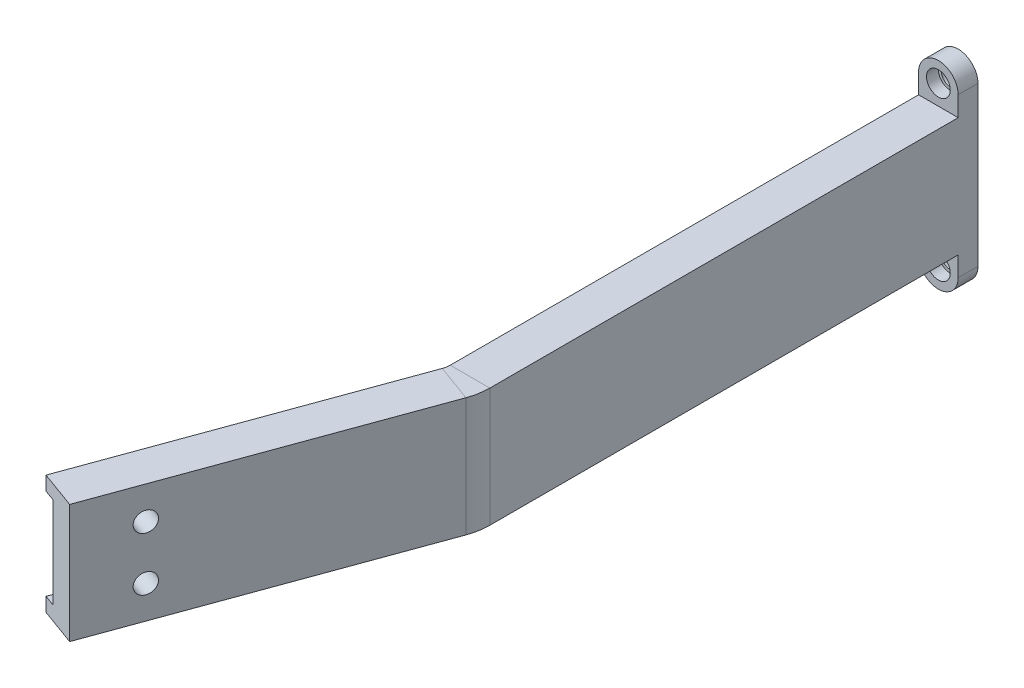
ISO-10303-21;
HEADER;
FILE_DESCRIPTION(('STEP AP214'),'2;1');
FILE_NAME('part.step','',(''),(''),'','','');
FILE_SCHEMA(('AUTOMOTIVE_DESIGN { 1 0 10303 214 1 1 1 1 }'));
ENDSEC;
DATA;
#1=APPLICATION_CONTEXT('core data for automotive mechanical design processes');
#2=APPLICATION_PROTOCOL_DEFINITION('international standard','automotive_design',2000,#1);
#3=PRODUCT_CONTEXT('',#1,'mechanical');
#4=PRODUCT('Part','Part','',(#3));
#5=PRODUCT_RELATED_PRODUCT_CATEGORY('part','',(#4));
#6=PRODUCT_DEFINITION_FORMATION('','',#4);
#7=PRODUCT_DEFINITION_CONTEXT('part definition',#1,'design');
#8=PRODUCT_DEFINITION('design','',#6,#7);
#9=PRODUCT_DEFINITION_SHAPE('','',#8);
#10=(LENGTH_UNIT() NAMED_UNIT(*) SI_UNIT(.MILLI.,.METRE.));
#11=(NAMED_UNIT(*) PLANE_ANGLE_UNIT() SI_UNIT($,.RADIAN.));
#12=(NAMED_UNIT(*) SI_UNIT($,.STERADIAN.) SOLID_ANGLE_UNIT());
#13=UNCERTAINTY_MEASURE_WITH_UNIT(LENGTH_MEASURE(1.E-05),#10,'distance_accuracy_value','');
#14=(GEOMETRIC_REPRESENTATION_CONTEXT(3) GLOBAL_UNCERTAINTY_ASSIGNED_CONTEXT((#13)) GLOBAL_UNIT_ASSIGNED_CONTEXT((#10,
#11,#12)) REPRESENTATION_CONTEXT('',''));
#15=CARTESIAN_POINT('',(0.,0.,0.));
#16=DIRECTION('',(0.,0.,1.));
#17=DIRECTION('',(1.,0.,0.));
#18=AXIS2_PLACEMENT_3D('',#15,#16,#17);
#19=CARTESIAN_POINT('',(155.297767569966,-11.5,9.99999999999995));
#20=DIRECTION('',(-1.,0.,0.));
#21=DIRECTION('',(0.,0.,1.));
#22=AXIS2_PLACEMENT_3D('',#19,#20,#21);
#23=PLANE('',#22);
#24=DIRECTION('',(0.,0.,1.));
#25=VECTOR('',#24,1.);
#26=CARTESIAN_POINT('',(155.297767569966,11.5,9.99999999999995));
#27=LINE('',#26,#25);
#28=CARTESIAN_POINT('',(155.297767569966,11.5,155.));
#29=VERTEX_POINT('',#28);
#30=CARTESIAN_POINT('',(155.297767569965,11.5,278.236730192915));
#31=VERTEX_POINT('',#30);
#32=EDGE_CURVE('E242',#29,#31,#27,.T.);
#33=ORIENTED_EDGE('',*,*,#32,.F.);
#34=DIRECTION('',(0.,-1.,0.));
#35=VECTOR('',#34,1.);
#36=CARTESIAN_POINT('',(155.297767569966,-11.5,155.));
#37=LINE('',#36,#35);
#38=CARTESIAN_POINT('',(155.297767569966,-11.5,155.));
#39=VERTEX_POINT('',#38);
#40=EDGE_CURVE('E403',#29,#39,#37,.T.);
#41=ORIENTED_EDGE('',*,*,#40,.T.);
#42=DIRECTION('',(0.,0.,1.));
#43=VECTOR('',#42,1.);
#44=CARTESIAN_POINT('',(155.297767569966,-11.5,9.99999999999995));
#45=LINE('',#44,#43);
#46=CARTESIAN_POINT('',(155.297767569965,-11.5,278.236730192915));
#47=VERTEX_POINT('',#46);
#48=EDGE_CURVE('E241',#39,#47,#45,.T.);
#49=ORIENTED_EDGE('',*,*,#48,.T.);
#50=DIRECTION('',(0.,1.,0.));
#51=VECTOR('',#50,1.);
#52=CARTESIAN_POINT('',(155.297767569965,-11.5,278.236730192915));
#53=LINE('',#52,#51);
#54=EDGE_CURVE('E238',#31,#47,#53,.F.);
#55=ORIENTED_EDGE('',*,*,#54,.F.);
#56=EDGE_LOOP('',(#33,#41,#49,#55));
#57=FACE_BOUND('',#56,.T.);
#58=ADVANCED_FACE('F40',(#57),#23,.T.);
#59=CARTESIAN_POINT('',(155.297767569966,-11.5,9.99999999999995));
#60=DIRECTION('',(0.,1.,0.));
#61=DIRECTION('',(0.,0.,1.));
#62=AXIS2_PLACEMENT_3D('',#59,#60,#61);
#63=PLANE('',#62);
#64=ORIENTED_EDGE('',*,*,#48,.F.);
#65=DIRECTION('',(-1.,0.,0.));
#66=VECTOR('',#65,1.);
#67=CARTESIAN_POINT('',(155.297767569966,-11.5,155.));
#68=LINE('',#67,#66);
#69=CARTESIAN_POINT('',(152.297767569966,-11.5,155.));
#70=VERTEX_POINT('',#69);
#71=EDGE_CURVE('E407',#39,#70,#68,.T.);
#72=ORIENTED_EDGE('',*,*,#71,.T.);
#73=DIRECTION('',(0.,0.,1.));
#74=VECTOR('',#73,1.);
#75=CARTESIAN_POINT('',(152.297767569966,-11.5,9.99999999999995));
#76=LINE('',#75,#74);
#77=CARTESIAN_POINT('',(152.297767569966,-11.5,278.236730192915));
#78=VERTEX_POINT('',#77);
#79=EDGE_CURVE('E269',#70,#78,#76,.T.);
#80=ORIENTED_EDGE('',*,*,#79,.T.);
#81=DIRECTION('',(1.,0.,0.));
#82=VECTOR('',#81,1.);
#83=CARTESIAN_POINT('',(155.297767569965,-11.5,278.236730192915));
#84=LINE('',#83,#82);
#85=EDGE_CURVE('E244',#47,#78,#84,.F.);
#86=ORIENTED_EDGE('',*,*,#85,.F.);
#87=EDGE_LOOP('',(#64,#72,#80,#86));
#88=FACE_BOUND('',#87,.T.);
#89=ADVANCED_FACE('F406',(#88),#63,.T.);
#90=CARTESIAN_POINT('',(152.297767569966,-15.,9.99999999999995));
#91=DIRECTION('',(-1.,1.50408162385987E-13,0.));
#92=DIRECTION('',(-1.50408162385987E-13,-1.,0.));
#93=AXIS2_PLACEMENT_3D('',#90,#91,#92);
#94=PLANE('',#93);
#95=ORIENTED_EDGE('',*,*,#79,.F.);
#96=DIRECTION('',(-1.50408162385987E-13,-1.,0.));
#97=VECTOR('',#96,1.);
#98=CARTESIAN_POINT('',(152.297767569966,-15.,155.));
#99=LINE('',#98,#97);
#100=CARTESIAN_POINT('',(152.297767569966,-19.9999999999989,155.));
#101=VERTEX_POINT('',#100);
#102=EDGE_CURVE('E452',#70,#101,#99,.T.);
#103=ORIENTED_EDGE('',*,*,#102,.T.);
#104=DIRECTION('',(0.,0.,-1.));
#105=VECTOR('',#104,1.);
#106=CARTESIAN_POINT('',(152.297767569966,-19.9999999999989,160.));
#107=LINE('',#106,#105);
#108=CARTESIAN_POINT('',(152.297767569966,-19.9999999999989,160.));
#109=VERTEX_POINT('',#108);
#110=EDGE_CURVE('E217',#109,#101,#107,.T.);
#111=ORIENTED_EDGE('',*,*,#110,.F.);
#112=DIRECTION('',(0.,-1.,0.));
#113=VECTOR('',#112,1.);
#114=CARTESIAN_POINT('',(152.297767569965,-14.9999999999989,160.));
#115=LINE('',#114,#113);
#116=CARTESIAN_POINT('',(152.297767569966,-15.,160.));
#117=VERTEX_POINT('',#116);
#118=EDGE_CURVE('E220',#117,#109,#115,.T.);
#119=ORIENTED_EDGE('',*,*,#118,.F.);
#120=DIRECTION('',(0.,0.,1.));
#121=VECTOR('',#120,1.);
#122=CARTESIAN_POINT('',(152.297767569966,-15.,9.99999999999995));
#123=LINE('',#122,#121);
#124=CARTESIAN_POINT('',(152.297767569965,-15.,278.236730192915));
#125=VERTEX_POINT('',#124);
#126=EDGE_CURVE('E285',#117,#125,#123,.T.);
#127=ORIENTED_EDGE('',*,*,#126,.T.);
#128=DIRECTION('',(1.50408162385987E-13,1.,0.));
#129=VECTOR('',#128,1.);
#130=CARTESIAN_POINT('',(152.297767569965,-15.,278.236730192915));
#131=LINE('',#130,#129);
#132=EDGE_CURVE('E271',#78,#125,#131,.F.);
#133=ORIENTED_EDGE('',*,*,#132,.F.);
#134=EDGE_LOOP('',(#95,#103,#111,#119,#127,#133));
#135=FACE_BOUND('',#134,.T.);
#136=ADVANCED_FACE('F415',(#135),#94,.T.);
#137=CARTESIAN_POINT('',(162.297767569966,-15.,9.99999999999995));
#138=DIRECTION('',(1.,0.,0.));
#139=DIRECTION('',(0.,0.,-1.));
#140=AXIS2_PLACEMENT_3D('',#137,#138,#139);
#141=PLANE('',#140);
#142=DIRECTION('',(0.,0.,-1.));
#143=VECTOR('',#142,1.);
#144=CARTESIAN_POINT('',(162.297767569966,-19.9999999999989,160.));
#145=LINE('',#144,#143);
#146=CARTESIAN_POINT('',(162.297767569966,-19.9999999999989,160.));
#147=VERTEX_POINT('',#146);
#148=CARTESIAN_POINT('',(162.297767569966,-19.9999999999989,155.));
#149=VERTEX_POINT('',#148);
#150=EDGE_CURVE('E196',#147,#149,#145,.T.);
#151=ORIENTED_EDGE('',*,*,#150,.T.);
#152=DIRECTION('',(0.,1.,0.));
#153=VECTOR('',#152,1.);
#154=CARTESIAN_POINT('',(162.297767569966,-15.,155.));
#155=LINE('',#154,#153);
#156=CARTESIAN_POINT('',(162.297767569965,20.0000000000013,155.));
#157=VERTEX_POINT('',#156);
#158=EDGE_CURVE('E180',#149,#157,#155,.T.);
#159=ORIENTED_EDGE('',*,*,#158,.T.);
#160=DIRECTION('',(0.,0.,-1.));
#161=VECTOR('',#160,1.);
#162=CARTESIAN_POINT('',(162.297767569965,20.0000000000013,160.));
#163=LINE('',#162,#161);
#164=CARTESIAN_POINT('',(162.297767569965,20.0000000000013,160.));
#165=VERTEX_POINT('',#164);
#166=EDGE_CURVE('E193',#165,#157,#163,.T.);
#167=ORIENTED_EDGE('',*,*,#166,.F.);
#168=DIRECTION('',(0.,1.,0.));
#169=VECTOR('',#168,1.);
#170=CARTESIAN_POINT('',(162.297767569965,15.0000000000013,160.));
#171=LINE('',#170,#169);
#172=CARTESIAN_POINT('',(162.297767569966,15.,160.));
#173=VERTEX_POINT('',#172);
#174=EDGE_CURVE('E202',#173,#165,#171,.T.);
#175=ORIENTED_EDGE('',*,*,#174,.F.);
#176=DIRECTION('',(0.,0.,1.));
#177=VECTOR('',#176,1.);
#178=CARTESIAN_POINT('',(162.297767569966,15.,9.99999999999995));
#179=LINE('',#178,#177);
#180=CARTESIAN_POINT('',(162.297767569965,15.,278.236730192915));
#181=VERTEX_POINT('',#180);
#182=EDGE_CURVE('E65',#173,#181,#179,.T.);
#183=ORIENTED_EDGE('',*,*,#182,.T.);
#184=DIRECTION('',(0.,-1.,0.));
#185=VECTOR('',#184,1.);
#186=CARTESIAN_POINT('',(162.297767569965,-15.,278.236730192915));
#187=LINE('',#186,#185);
#188=CARTESIAN_POINT('',(162.297767569965,-15.,278.236730192915));
#189=VERTEX_POINT('',#188);
#190=EDGE_CURVE('E303',#189,#181,#187,.F.);
#191=ORIENTED_EDGE('',*,*,#190,.F.);
#192=DIRECTION('',(0.,0.,1.));
#193=VECTOR('',#192,1.);
#194=CARTESIAN_POINT('',(162.297767569966,-15.,9.99999999999995));
#195=LINE('',#194,#193);
#196=CARTESIAN_POINT('',(162.297767569965,-14.9999999999989,160.));
#197=VERTEX_POINT('',#196);
#198=EDGE_CURVE('E301',#197,#189,#195,.T.);
#199=ORIENTED_EDGE('',*,*,#198,.F.);
#200=DIRECTION('',(0.,1.,0.));
#201=VECTOR('',#200,1.);
#202=CARTESIAN_POINT('',(162.297767569965,-14.9999999999989,160.));
#203=LINE('',#202,#201);
#204=EDGE_CURVE('E225',#147,#197,#203,.T.);
#205=ORIENTED_EDGE('',*,*,#204,.F.);
#206=EDGE_LOOP('',(#151,#159,#167,#175,#183,#191,#199,#205));
#207=FACE_BOUND('',#206,.T.);
#208=ADVANCED_FACE('F191',(#207),#141,.T.);
#209=CARTESIAN_POINT('',(152.297767569966,11.5,9.99999999999995));
#210=DIRECTION('',(-1.,0.,0.));
#211=DIRECTION('',(0.,0.,1.));
#212=AXIS2_PLACEMENT_3D('',#209,#210,#211);
#213=PLANE('',#212);
#214=DIRECTION('',(0.,0.,-1.));
#215=VECTOR('',#214,1.);
#216=CARTESIAN_POINT('',(152.297767569965,20.0000000000009,160.));
#217=LINE('',#216,#215);
#218=CARTESIAN_POINT('',(152.297767569965,20.0000000000009,160.));
#219=VERTEX_POINT('',#218);
#220=CARTESIAN_POINT('',(152.297767569965,20.0000000000009,155.));
#221=VERTEX_POINT('',#220);
#222=EDGE_CURVE('E203',#219,#221,#217,.T.);
#223=ORIENTED_EDGE('',*,*,#222,.T.);
#224=DIRECTION('',(0.,-1.,0.));
#225=VECTOR('',#224,1.);
#226=CARTESIAN_POINT('',(152.297767569966,11.5,155.));
#227=LINE('',#226,#225);
#228=CARTESIAN_POINT('',(152.297767569966,11.5,155.));
#229=VERTEX_POINT('',#228);
#230=EDGE_CURVE('E57',#221,#229,#227,.T.);
#231=ORIENTED_EDGE('',*,*,#230,.T.);
#232=DIRECTION('',(0.,0.,1.));
#233=VECTOR('',#232,1.);
#234=CARTESIAN_POINT('',(152.297767569966,11.5,9.99999999999995));
#235=LINE('',#234,#233);
#236=CARTESIAN_POINT('',(152.297767569965,11.5,278.236730192915));
#237=VERTEX_POINT('',#236);
#238=EDGE_CURVE('E348',#229,#237,#235,.T.);
#239=ORIENTED_EDGE('',*,*,#238,.T.);
#240=DIRECTION('',(0.,1.,0.));
#241=VECTOR('',#240,1.);
#242=CARTESIAN_POINT('',(152.297767569965,11.5,278.236730192915));
#243=LINE('',#242,#241);
#244=CARTESIAN_POINT('',(152.297767569965,15.,278.236730192915));
#245=VERTEX_POINT('',#244);
#246=EDGE_CURVE('E334',#245,#237,#243,.F.);
#247=ORIENTED_EDGE('',*,*,#246,.F.);
#248=DIRECTION('',(0.,0.,1.));
#249=VECTOR('',#248,1.);
#250=CARTESIAN_POINT('',(152.297767569966,15.,9.99999999999995));
#251=LINE('',#250,#249);
#252=CARTESIAN_POINT('',(152.297767569965,15.0000000000009,160.));
#253=VERTEX_POINT('',#252);
#254=EDGE_CURVE('E332',#253,#245,#251,.T.);
#255=ORIENTED_EDGE('',*,*,#254,.F.);
#256=DIRECTION('',(0.,-1.,0.));
#257=VECTOR('',#256,1.);
#258=CARTESIAN_POINT('',(152.297767569965,15.0000000000009,160.));
#259=LINE('',#258,#257);
#260=EDGE_CURVE('E212',#219,#253,#259,.T.);
#261=ORIENTED_EDGE('',*,*,#260,.F.);
#262=EDGE_LOOP('',(#223,#231,#239,#247,#255,#261));
#263=FACE_BOUND('',#262,.T.);
#264=ADVANCED_FACE('F442',(#263),#213,.T.);
#265=CARTESIAN_POINT('',(155.297767569966,11.5,9.99999999999995));
#266=DIRECTION('',(0.,-1.,0.));
#267=DIRECTION('',(0.,0.,-1.));
#268=AXIS2_PLACEMENT_3D('',#265,#266,#267);
#269=PLANE('',#268);
#270=ORIENTED_EDGE('',*,*,#238,.F.);
#271=DIRECTION('',(1.,0.,0.));
#272=VECTOR('',#271,1.);
#273=CARTESIAN_POINT('',(155.297767569966,11.5,155.));
#274=LINE('',#273,#272);
#275=EDGE_CURVE('E451',#229,#29,#274,.T.);
#276=ORIENTED_EDGE('',*,*,#275,.T.);
#277=ORIENTED_EDGE('',*,*,#32,.T.);
#278=DIRECTION('',(-1.,0.,0.));
#279=VECTOR('',#278,1.);
#280=CARTESIAN_POINT('',(155.297767569965,11.5,278.236730192915));
#281=LINE('',#280,#279);
#282=EDGE_CURVE('E256',#237,#31,#281,.F.);
#283=ORIENTED_EDGE('',*,*,#282,.F.);
#284=EDGE_LOOP('',(#270,#276,#277,#283));
#285=FACE_BOUND('',#284,.T.);
#286=ADVANCED_FACE('F450',(#285),#269,.T.);
#287=CARTESIAN_POINT('',(157.297767569966,-19.9999999999989,160.));
#288=DIRECTION('',(0.,0.,-1.));
#289=DIRECTION('',(-1.,0.,0.));
#290=AXIS2_PLACEMENT_3D('',#287,#288,#289);
#291=CYLINDRICAL_SURFACE('',#290,5.);
#292=CARTESIAN_POINT('',(157.297767569966,-19.9999999999989,155.));
#293=DIRECTION('',(0.,0.,-1.));
#294=DIRECTION('',(-1.,0.,0.));
#295=AXIS2_PLACEMENT_3D('',#292,#293,#294);
#296=CIRCLE('',#295,5.);
#297=EDGE_CURVE('E197',#149,#101,#296,.T.);
#298=ORIENTED_EDGE('',*,*,#297,.F.);
#299=ORIENTED_EDGE('',*,*,#150,.F.);
#300=CARTESIAN_POINT('',(157.297767569966,-19.9999999999989,160.));
#301=DIRECTION('',(0.,0.,1.));
#302=DIRECTION('',(1.,0.,0.));
#303=AXIS2_PLACEMENT_3D('',#300,#301,#302);
#304=CIRCLE('',#303,5.);
#305=EDGE_CURVE('E228',#109,#147,#304,.T.);
#306=ORIENTED_EDGE('',*,*,#305,.F.);
#307=ORIENTED_EDGE('',*,*,#110,.T.);
#308=EDGE_LOOP('',(#298,#299,#306,#307));
#309=FACE_BOUND('',#308,.T.);
#310=ADVANCED_FACE('F500',(#309),#291,.T.);
#311=CARTESIAN_POINT('',(157.297767569965,20.0000000000009,160.));
#312=DIRECTION('',(0.,0.,-1.));
#313=DIRECTION('',(-1.,0.,0.));
#314=AXIS2_PLACEMENT_3D('',#311,#312,#313);
#315=CYLINDRICAL_SURFACE('',#314,5.);
#316=CARTESIAN_POINT('',(157.297767569965,20.0000000000009,155.));
#317=DIRECTION('',(0.,0.,-1.));
#318=DIRECTION('',(-1.,0.,0.));
#319=AXIS2_PLACEMENT_3D('',#316,#317,#318);
#320=CIRCLE('',#319,5.);
#321=EDGE_CURVE('E176',#221,#157,#320,.T.);
#322=ORIENTED_EDGE('',*,*,#321,.F.);
#323=ORIENTED_EDGE('',*,*,#222,.F.);
#324=CARTESIAN_POINT('',(157.297767569965,20.0000000000009,160.));
#325=DIRECTION('',(0.,0.,1.));
#326=DIRECTION('',(-1.,0.,0.));
#327=AXIS2_PLACEMENT_3D('',#324,#325,#326);
#328=CIRCLE('',#327,5.);
#329=EDGE_CURVE('E201',#165,#219,#328,.T.);
#330=ORIENTED_EDGE('',*,*,#329,.F.);
#331=ORIENTED_EDGE('',*,*,#166,.T.);
#332=EDGE_LOOP('',(#322,#323,#330,#331));
#333=FACE_BOUND('',#332,.T.);
#334=ADVANCED_FACE('F199',(#333),#315,.T.);
#335=CARTESIAN_POINT('',(157.297767569965,20.0000000000009,160.));
#336=DIRECTION('',(0.,0.,1.));
#337=DIRECTION('',(1.,0.,0.));
#338=AXIS2_PLACEMENT_3D('',#335,#336,#337);
#339=CYLINDRICAL_SURFACE('',#338,2.25);
#340=CARTESIAN_POINT('',(157.297767569965,20.0000000000009,157.));
#341=DIRECTION('',(0.,0.,1.));
#342=DIRECTION('',(1.,0.,0.));
#343=AXIS2_PLACEMENT_3D('',#340,#341,#342);
#344=CIRCLE('',#343,2.25);
#345=CARTESIAN_POINT('',(159.547767569965,20.0000000000009,157.));
#346=VERTEX_POINT('',#345);
#347=EDGE_CURVE('E468',#346,#346,#344,.T.);
#348=ORIENTED_EDGE('',*,*,#347,.T.);
#349=EDGE_LOOP('',(#348));
#350=FACE_BOUND('',#349,.T.);
#351=CARTESIAN_POINT('',(157.297767569965,20.0000000000009,155.));
#352=DIRECTION('',(0.,0.,-1.));
#353=DIRECTION('',(-1.,0.,0.));
#354=AXIS2_PLACEMENT_3D('',#351,#352,#353);
#355=CIRCLE('',#354,2.25);
#356=CARTESIAN_POINT('',(155.047767569965,20.0000000000009,155.));
#357=VERTEX_POINT('',#356);
#358=EDGE_CURVE('E459',#357,#357,#355,.F.);
#359=ORIENTED_EDGE('',*,*,#358,.F.);
#360=EDGE_LOOP('',(#359));
#361=FACE_BOUND('',#360,.T.);
#362=ADVANCED_FACE('F507',(#350,#361),#339,.F.);
#363=CARTESIAN_POINT('',(162.297767569966,15.,9.99999999999995));
#364=DIRECTION('',(0.,1.,0.));
#365=DIRECTION('',(-1.,0.,0.));
#366=AXIS2_PLACEMENT_3D('',#363,#364,#365);
#367=PLANE('',#366);
#368=ORIENTED_EDGE('',*,*,#182,.F.);
#369=DIRECTION('',(1.,0.,0.));
#370=VECTOR('',#369,1.);
#371=CARTESIAN_POINT('',(162.297767569965,15.0000000000013,160.));
#372=LINE('',#371,#370);
#373=EDGE_CURVE('E205',#253,#173,#372,.T.);
#374=ORIENTED_EDGE('',*,*,#373,.F.);
#375=ORIENTED_EDGE('',*,*,#254,.T.);
#376=DIRECTION('',(1.,0.,0.));
#377=VECTOR('',#376,1.);
#378=CARTESIAN_POINT('',(162.297767569965,15.,278.236730192915));
#379=LINE('',#378,#377);
#380=EDGE_CURVE('E318',#181,#245,#379,.F.);
#381=ORIENTED_EDGE('',*,*,#380,.F.);
#382=EDGE_LOOP('',(#368,#374,#375,#381));
#383=FACE_BOUND('',#382,.T.);
#384=ADVANCED_FACE('F435',(#383),#367,.T.);
#385=CARTESIAN_POINT('',(-98.8876895220948,0.,271.691694023993));
#386=DIRECTION('',(0.342020143325671,0.,-0.939692620785908));
#387=DIRECTION('',(0.939692620785908,0.,0.342020143325671));
#388=AXIS2_PLACEMENT_3D('',#385,#386,#387);
#389=PLANE('',#388);
#390=DIRECTION('',(0.,1.,0.));
#391=VECTOR('',#390,1.);
#392=CARTESIAN_POINT('',(125.30153689607,11.5,353.289899283372));
#393=LINE('',#392,#391);
#394=CARTESIAN_POINT('',(125.30153689607,15.,353.289899283372));
#395=VERTEX_POINT('',#394);
#396=CARTESIAN_POINT('',(125.30153689607,11.5,353.289899283372));
#397=VERTEX_POINT('',#396);
#398=EDGE_CURVE('E345',#395,#397,#393,.F.);
#399=ORIENTED_EDGE('',*,*,#398,.T.);
#400=DIRECTION('',(-0.93969262078591,0.,-0.342020143325663));
#401=VECTOR('',#400,1.);
#402=CARTESIAN_POINT('',(128.120614758428,11.5,354.315959713349));
#403=LINE('',#402,#401);
#404=CARTESIAN_POINT('',(128.120614758428,11.5,354.315959713349));
#405=VERTEX_POINT('',#404);
#406=EDGE_CURVE('E11',#397,#405,#403,.F.);
#407=ORIENTED_EDGE('',*,*,#406,.T.);
#408=DIRECTION('',(0.,1.,0.));
#409=VECTOR('',#408,1.);
#410=CARTESIAN_POINT('',(128.120614758428,-11.5,354.315959713349));
#411=LINE('',#410,#409);
#412=CARTESIAN_POINT('',(128.120614758428,-11.5,354.315959713349));
#413=VERTEX_POINT('',#412);
#414=EDGE_CURVE('E257',#405,#413,#411,.F.);
#415=ORIENTED_EDGE('',*,*,#414,.T.);
#416=DIRECTION('',(0.939692620785909,0.,0.342020143325668));
#417=VECTOR('',#416,1.);
#418=CARTESIAN_POINT('',(128.120614758428,-11.5,354.315959713349));
#419=LINE('',#418,#417);
#420=CARTESIAN_POINT('',(125.301536896071,-11.5,353.289899283372));
#421=VERTEX_POINT('',#420);
#422=EDGE_CURVE('E263',#413,#421,#419,.F.);
#423=ORIENTED_EDGE('',*,*,#422,.T.);
#424=DIRECTION('',(1.42742960308949E-13,1.,0.));
#425=VECTOR('',#424,1.);
#426=CARTESIAN_POINT('',(125.30153689607,-15.,353.289899283372));
#427=LINE('',#426,#425);
#428=CARTESIAN_POINT('',(125.30153689607,-15.,353.289899283372));
#429=VERTEX_POINT('',#428);
#430=EDGE_CURVE('E282',#421,#429,#427,.F.);
#431=ORIENTED_EDGE('',*,*,#430,.T.);
#432=DIRECTION('',(-0.939692620785908,0.,-0.342020143325671));
#433=VECTOR('',#432,1.);
#434=CARTESIAN_POINT('',(134.69846310393,-15.,356.710100716628));
#435=LINE('',#434,#433);
#436=CARTESIAN_POINT('',(134.69846310393,-15.,356.710100716628));
#437=VERTEX_POINT('',#436);
#438=EDGE_CURVE('E298',#429,#437,#435,.F.);
#439=ORIENTED_EDGE('',*,*,#438,.T.);
#440=DIRECTION('',(0.,-1.,0.));
#441=VECTOR('',#440,1.);
#442=CARTESIAN_POINT('',(134.69846310393,-15.,356.710100716628));
#443=LINE('',#442,#441);
#444=CARTESIAN_POINT('',(134.69846310393,15.,356.710100716628));
#445=VERTEX_POINT('',#444);
#446=EDGE_CURVE('E314',#437,#445,#443,.F.);
#447=ORIENTED_EDGE('',*,*,#446,.T.);
#448=DIRECTION('',(0.939692620785908,0.,0.342020143325671));
#449=VECTOR('',#448,1.);
#450=CARTESIAN_POINT('',(134.69846310393,15.,356.710100716628));
#451=LINE('',#450,#449);
#452=EDGE_CURVE('E329',#445,#395,#451,.F.);
#453=ORIENTED_EDGE('',*,*,#452,.T.);
#454=EDGE_LOOP('',(#399,#407,#415,#423,#431,#439,#447,#453));
#455=FACE_BOUND('',#454,.T.);
#456=ADVANCED_FACE('F42',(#455),#389,.F.);
#457=CARTESIAN_POINT('',(162.297767569966,-15.,9.99999999999995));
#458=DIRECTION('',(0.,-1.,0.));
#459=DIRECTION('',(1.,0.,0.));
#460=AXIS2_PLACEMENT_3D('',#457,#458,#459);
#461=PLANE('',#460);
#462=DIRECTION('',(-1.,0.,0.));
#463=VECTOR('',#462,1.);
#464=CARTESIAN_POINT('',(162.297767569965,-14.9999999999989,160.));
#465=LINE('',#464,#463);
#466=EDGE_CURVE('E222',#197,#117,#465,.T.);
#467=ORIENTED_EDGE('',*,*,#466,.F.);
#468=ORIENTED_EDGE('',*,*,#198,.T.);
#469=DIRECTION('',(-1.,0.,0.));
#470=VECTOR('',#469,1.);
#471=CARTESIAN_POINT('',(162.297767569965,-15.,278.236730192915));
#472=LINE('',#471,#470);
#473=EDGE_CURVE('E287',#125,#189,#472,.F.);
#474=ORIENTED_EDGE('',*,*,#473,.F.);
#475=ORIENTED_EDGE('',*,*,#126,.F.);
#476=EDGE_LOOP('',(#467,#468,#474,#475));
#477=FACE_BOUND('',#476,.T.);
#478=ADVANCED_FACE('F425',(#477),#461,.T.);
#479=CARTESIAN_POINT('',(147.297767569966,0.,278.236730192915));
#480=DIRECTION('',(0.,-1.,0.));
#481=DIRECTION('',(0.,0.,-1.));
#482=AXIS2_PLACEMENT_3D('',#479,#480,#481);
#483=CYLINDRICAL_SURFACE('',#482,7.99999999999945);
#484=CARTESIAN_POINT('',(147.297767569966,-11.5,278.236730192915));
#485=DIRECTION('',(0.,-1.,0.));
#486=DIRECTION('',(1.,0.,0.));
#487=AXIS2_PLACEMENT_3D('',#484,#485,#486);
#488=CIRCLE('',#487,7.99999999999945);
#489=CARTESIAN_POINT('',(154.815308536255,-11.5,280.972891339514));
#490=VERTEX_POINT('',#489);
#491=EDGE_CURVE('E249',#47,#490,#488,.T.);
#492=ORIENTED_EDGE('',*,*,#491,.T.);
#493=DIRECTION('',(0.,1.,0.));
#494=VECTOR('',#493,1.);
#495=CARTESIAN_POINT('',(154.815308536263,-11.5,280.972891339517));
#496=LINE('',#495,#494);
#497=CARTESIAN_POINT('',(154.815308536255,11.5,280.972891339514));
#498=VERTEX_POINT('',#497);
#499=EDGE_CURVE('E246',#498,#490,#496,.F.);
#500=ORIENTED_EDGE('',*,*,#499,.F.);
#501=CARTESIAN_POINT('',(147.297767569966,11.5,278.236730192915));
#502=DIRECTION('',(0.,-1.,0.));
#503=DIRECTION('',(1.,0.,0.));
#504=AXIS2_PLACEMENT_3D('',#501,#502,#503);
#505=CIRCLE('',#504,7.99999999999945);
#506=EDGE_CURVE('E250',#31,#498,#505,.T.);
#507=ORIENTED_EDGE('',*,*,#506,.F.);
#508=ORIENTED_EDGE('',*,*,#54,.T.);
#509=EDGE_LOOP('',(#492,#500,#507,#508));
#510=FACE_BOUND('',#509,.T.);
#511=ADVANCED_FACE('F396',(#510),#483,.F.);
#512=CARTESIAN_POINT('',(155.297767569965,-11.5,278.236730192915));
#513=DIRECTION('',(0.,1.,0.));
#514=DIRECTION('',(0.,0.,1.));
#515=AXIS2_PLACEMENT_3D('',#512,#513,#514);
#516=PLANE('',#515);
#517=CARTESIAN_POINT('',(147.297767569966,-11.5,278.236730192915));
#518=DIRECTION('',(0.,-1.,0.));
#519=DIRECTION('',(1.,0.,0.));
#520=AXIS2_PLACEMENT_3D('',#517,#518,#519);
#521=CIRCLE('',#520,4.99999999999995);
#522=CARTESIAN_POINT('',(151.996230673898,-11.5,279.946830909537));
#523=VERTEX_POINT('',#522);
#524=EDGE_CURVE('E274',#78,#523,#521,.T.);
#525=ORIENTED_EDGE('',*,*,#524,.T.);
#526=DIRECTION('',(0.939692620785909,0.,0.342020143325668));
#527=VECTOR('',#526,1.);
#528=CARTESIAN_POINT('',(154.815308536263,-11.5,280.972891339517));
#529=LINE('',#528,#527);
#530=EDGE_CURVE('E253',#490,#523,#529,.F.);
#531=ORIENTED_EDGE('',*,*,#530,.F.);
#532=ORIENTED_EDGE('',*,*,#491,.F.);
#533=ORIENTED_EDGE('',*,*,#85,.T.);
#534=EDGE_LOOP('',(#525,#531,#532,#533));
#535=FACE_BOUND('',#534,.T.);
#536=ADVANCED_FACE('F392',(#535),#516,.T.);
#537=CARTESIAN_POINT('',(147.297767569966,0.,278.236730192915));
#538=DIRECTION('',(0.,-1.,0.));
#539=DIRECTION('',(0.,0.,-1.));
#540=AXIS2_PLACEMENT_3D('',#537,#538,#539);
#541=CYLINDRICAL_SURFACE('',#540,4.99999999999971);
#542=CARTESIAN_POINT('',(147.297767569966,-15.,278.236730192915));
#543=DIRECTION('',(0.,-1.,0.));
#544=DIRECTION('',(1.,0.,0.));
#545=AXIS2_PLACEMENT_3D('',#542,#543,#544);
#546=CIRCLE('',#545,4.99999999999945);
#547=CARTESIAN_POINT('',(151.996230673897,-15.,279.946830909537));
#548=VERTEX_POINT('',#547);
#549=EDGE_CURVE('E290',#125,#548,#546,.T.);
#550=ORIENTED_EDGE('',*,*,#549,.T.);
#551=DIRECTION('',(1.42742960308949E-13,1.,0.));
#552=VECTOR('',#551,1.);
#553=CARTESIAN_POINT('',(151.996230673905,-15.,279.94683090954));
#554=LINE('',#553,#552);
#555=EDGE_CURVE('E277',#523,#548,#554,.F.);
#556=ORIENTED_EDGE('',*,*,#555,.F.);
#557=ORIENTED_EDGE('',*,*,#524,.F.);
#558=ORIENTED_EDGE('',*,*,#132,.T.);
#559=EDGE_LOOP('',(#550,#556,#557,#558));
#560=FACE_BOUND('',#559,.T.);
#561=ADVANCED_FACE('F414',(#560),#541,.F.);
#562=CARTESIAN_POINT('',(162.297767569965,-15.,278.236730192915));
#563=DIRECTION('',(0.,-1.,0.));
#564=DIRECTION('',(0.,0.,-1.));
#565=AXIS2_PLACEMENT_3D('',#562,#563,#564);
#566=PLANE('',#565);
#567=CARTESIAN_POINT('',(147.297767569966,-15.,278.236730192915));
#568=DIRECTION('',(0.,-1.,0.));
#569=DIRECTION('',(1.,0.,0.));
#570=AXIS2_PLACEMENT_3D('',#567,#568,#569);
#571=CIRCLE('',#570,14.9999999999995);
#572=CARTESIAN_POINT('',(161.393156881756,-15.,283.367032342794));
#573=VERTEX_POINT('',#572);
#574=EDGE_CURVE('E306',#189,#573,#571,.T.);
#575=ORIENTED_EDGE('',*,*,#574,.T.);
#576=DIRECTION('',(-0.939692620785908,0.,-0.342020143325671));
#577=VECTOR('',#576,1.);
#578=CARTESIAN_POINT('',(161.393156881764,-15.,283.367032342797));
#579=LINE('',#578,#577);
#580=EDGE_CURVE('E293',#548,#573,#579,.F.);
#581=ORIENTED_EDGE('',*,*,#580,.F.);
#582=ORIENTED_EDGE('',*,*,#549,.F.);
#583=ORIENTED_EDGE('',*,*,#473,.T.);
#584=EDGE_LOOP('',(#575,#581,#582,#583));
#585=FACE_BOUND('',#584,.T.);
#586=ADVANCED_FACE('F424',(#585),#566,.T.);
#587=CARTESIAN_POINT('',(147.297767569966,0.,278.236730192915));
#588=DIRECTION('',(0.,-1.,0.));
#589=DIRECTION('',(0.,0.,-1.));
#590=AXIS2_PLACEMENT_3D('',#587,#588,#589);
#591=CYLINDRICAL_SURFACE('',#590,14.9999999999995);
#592=CARTESIAN_POINT('',(147.297767569966,15.,278.236730192915));
#593=DIRECTION('',(0.,-1.,0.));
#594=DIRECTION('',(1.,0.,0.));
#595=AXIS2_PLACEMENT_3D('',#592,#593,#594);
#596=CIRCLE('',#595,14.9999999999995);
#597=CARTESIAN_POINT('',(161.393156881756,15.,283.367032342794));
#598=VERTEX_POINT('',#597);
#599=EDGE_CURVE('E321',#181,#598,#596,.T.);
#600=ORIENTED_EDGE('',*,*,#599,.T.);
#601=DIRECTION('',(0.,-1.,0.));
#602=VECTOR('',#601,1.);
#603=CARTESIAN_POINT('',(161.393156881764,-15.,283.367032342797));
#604=LINE('',#603,#602);
#605=EDGE_CURVE('E309',#573,#598,#604,.F.);
#606=ORIENTED_EDGE('',*,*,#605,.F.);
#607=ORIENTED_EDGE('',*,*,#574,.F.);
#608=ORIENTED_EDGE('',*,*,#190,.T.);
#609=EDGE_LOOP('',(#600,#606,#607,#608));
#610=FACE_BOUND('',#609,.T.);
#611=ADVANCED_FACE('F430',(#610),#591,.T.);
#612=CARTESIAN_POINT('',(162.297767569965,15.,278.236730192915));
#613=DIRECTION('',(0.,1.,0.));
#614=DIRECTION('',(0.,0.,1.));
#615=AXIS2_PLACEMENT_3D('',#612,#613,#614);
#616=PLANE('',#615);
#617=CARTESIAN_POINT('',(147.297767569966,15.,278.236730192915));
#618=DIRECTION('',(0.,-1.,0.));
#619=DIRECTION('',(1.,0.,0.));
#620=AXIS2_PLACEMENT_3D('',#617,#618,#619);
#621=CIRCLE('',#620,4.99999999999945);
#622=CARTESIAN_POINT('',(151.996230673897,15.,279.946830909537));
#623=VERTEX_POINT('',#622);
#624=EDGE_CURVE('E337',#245,#623,#621,.T.);
#625=ORIENTED_EDGE('',*,*,#624,.T.);
#626=DIRECTION('',(0.939692620785908,0.,0.342020143325671));
#627=VECTOR('',#626,1.);
#628=CARTESIAN_POINT('',(161.393156881764,15.,283.367032342797));
#629=LINE('',#628,#627);
#630=EDGE_CURVE('E324',#598,#623,#629,.F.);
#631=ORIENTED_EDGE('',*,*,#630,.F.);
#632=ORIENTED_EDGE('',*,*,#599,.F.);
#633=ORIENTED_EDGE('',*,*,#380,.T.);
#634=EDGE_LOOP('',(#625,#631,#632,#633));
#635=FACE_BOUND('',#634,.T.);
#636=ADVANCED_FACE('F434',(#635),#616,.T.);
#637=CARTESIAN_POINT('',(147.297767569966,0.,278.236730192915));
#638=DIRECTION('',(0.,-1.,0.));
#639=DIRECTION('',(0.,0.,-1.));
#640=AXIS2_PLACEMENT_3D('',#637,#638,#639);
#641=CYLINDRICAL_SURFACE('',#640,4.99999999999945);
#642=CARTESIAN_POINT('',(147.297767569966,11.5,278.236730192915));
#643=DIRECTION('',(0.,-1.,0.));
#644=DIRECTION('',(1.,0.,0.));
#645=AXIS2_PLACEMENT_3D('',#642,#643,#644);
#646=CIRCLE('',#645,4.99999999999945);
#647=CARTESIAN_POINT('',(151.996230673897,11.5,279.946830909537));
#648=VERTEX_POINT('',#647);
#649=EDGE_CURVE('E352',#237,#648,#646,.T.);
#650=ORIENTED_EDGE('',*,*,#649,.T.);
#651=DIRECTION('',(0.,1.,0.));
#652=VECTOR('',#651,1.);
#653=CARTESIAN_POINT('',(151.996230673905,11.5,279.94683090954));
#654=LINE('',#653,#652);
#655=EDGE_CURVE('E340',#623,#648,#654,.F.);
#656=ORIENTED_EDGE('',*,*,#655,.F.);
#657=ORIENTED_EDGE('',*,*,#624,.F.);
#658=ORIENTED_EDGE('',*,*,#246,.T.);
#659=EDGE_LOOP('',(#650,#656,#657,#658));
#660=FACE_BOUND('',#659,.T.);
#661=ADVANCED_FACE('F441',(#660),#641,.F.);
#662=CARTESIAN_POINT('',(155.297767569965,11.5,278.236730192915));
#663=DIRECTION('',(0.,-1.,0.));
#664=DIRECTION('',(0.,0.,-1.));
#665=AXIS2_PLACEMENT_3D('',#662,#663,#664);
#666=PLANE('',#665);
#667=DIRECTION('',(-0.93969262078591,0.,-0.342020143325663));
#668=VECTOR('',#667,1.);
#669=CARTESIAN_POINT('',(154.815308536263,11.5,280.972891339517));
#670=LINE('',#669,#668);
#671=EDGE_CURVE('E266',#648,#498,#670,.F.);
#672=ORIENTED_EDGE('',*,*,#671,.F.);
#673=ORIENTED_EDGE('',*,*,#649,.F.);
#674=ORIENTED_EDGE('',*,*,#282,.T.);
#675=ORIENTED_EDGE('',*,*,#506,.T.);
#676=EDGE_LOOP('',(#672,#673,#674,#675));
#677=FACE_BOUND('',#676,.T.);
#678=ADVANCED_FACE('F381',(#677),#666,.T.);
#679=CARTESIAN_POINT('',(154.815308536253,-11.5,280.972891339521));
#680=DIRECTION('',(-0.939692620785908,0.,-0.34202014332567));
#681=DIRECTION('',(-0.34202014332567,0.,0.939692620785908));
#682=AXIS2_PLACEMENT_3D('',#679,#680,#681);
#683=PLANE('',#682);
#684=CARTESIAN_POINT('',(133.250916908313,6.75,340.22057040156));
#685=DIRECTION('',(0.939692620785908,0.,0.34202014332567));
#686=DIRECTION('',(0.34202014332567,0.,-0.939692620785908));
#687=AXIS2_PLACEMENT_3D('',#684,#685,#686);
#688=CIRCLE('',#687,2.50000000000003);
#689=CARTESIAN_POINT('',(134.105967266627,6.75,337.871338849595));
#690=VERTEX_POINT('',#689);
#691=EDGE_CURVE('E232',#690,#690,#688,.T.);
#692=ORIENTED_EDGE('',*,*,#691,.T.);
#693=EDGE_LOOP('',(#692));
#694=FACE_BOUND('',#693,.T.);
#695=CARTESIAN_POINT('',(133.250916908313,-6.74999999999999,340.22057040156));
#696=DIRECTION('',(0.939692620785908,0.,0.34202014332567));
#697=DIRECTION('',(-0.34202014332567,0.,0.939692620785908));
#698=AXIS2_PLACEMENT_3D('',#695,#696,#697);
#699=CIRCLE('',#698,2.50000000000003);
#700=CARTESIAN_POINT('',(132.395866549999,-6.74999999999999,342.569801953525));
#701=VERTEX_POINT('',#700);
#702=EDGE_CURVE('E231',#701,#701,#699,.T.);
#703=ORIENTED_EDGE('',*,*,#702,.T.);
#704=EDGE_LOOP('',(#703));
#705=FACE_BOUND('',#704,.T.);
#706=DIRECTION('',(-0.34202014332567,0.,0.939692620785908));
#707=VECTOR('',#706,1.);
#708=CARTESIAN_POINT('',(154.815308536253,-11.5,280.972891339521));
#709=LINE('',#708,#707);
#710=EDGE_CURVE('E259',#490,#413,#709,.T.);
#711=ORIENTED_EDGE('',*,*,#710,.T.);
#712=ORIENTED_EDGE('',*,*,#414,.F.);
#713=DIRECTION('',(-0.34202014332567,0.,0.939692620785908));
#714=VECTOR('',#713,1.);
#715=CARTESIAN_POINT('',(154.815308536253,11.5,280.972891339521));
#716=LINE('',#715,#714);
#717=EDGE_CURVE('E260',#498,#405,#716,.T.);
#718=ORIENTED_EDGE('',*,*,#717,.F.);
#719=ORIENTED_EDGE('',*,*,#499,.T.);
#720=EDGE_LOOP('',(#711,#712,#718,#719));
#721=FACE_BOUND('',#720,.T.);
#722=ADVANCED_FACE('F377',(#694,#705,#721),#683,.T.);
#723=CARTESIAN_POINT('',(154.815308536253,-11.5,280.972891339521));
#724=DIRECTION('',(0.,1.,0.));
#725=DIRECTION('',(0.,0.,1.));
#726=AXIS2_PLACEMENT_3D('',#723,#724,#725);
#727=PLANE('',#726);
#728=DIRECTION('',(-0.34202014332567,0.,0.939692620785908));
#729=VECTOR('',#728,1.);
#730=CARTESIAN_POINT('',(151.996230673895,-11.5,279.946830909544));
#731=LINE('',#730,#729);
#732=EDGE_CURVE('E279',#523,#421,#731,.T.);
#733=ORIENTED_EDGE('',*,*,#732,.T.);
#734=ORIENTED_EDGE('',*,*,#422,.F.);
#735=ORIENTED_EDGE('',*,*,#710,.F.);
#736=ORIENTED_EDGE('',*,*,#530,.T.);
#737=EDGE_LOOP('',(#733,#734,#735,#736));
#738=FACE_BOUND('',#737,.T.);
#739=ADVANCED_FACE('F380',(#738),#727,.T.);
#740=CARTESIAN_POINT('',(151.996230673895,-15.,279.946830909544));
#741=DIRECTION('',(-0.939692620785908,1.50408162385987E-13,-0.34202014332567));
#742=DIRECTION('',(-0.34202014332567,0.,0.939692620785908));
#743=AXIS2_PLACEMENT_3D('',#740,#741,#742);
#744=PLANE('',#743);
#745=DIRECTION('',(-0.34202014332567,0.,0.939692620785908));
#746=VECTOR('',#745,1.);
#747=CARTESIAN_POINT('',(151.996230673895,-15.,279.946830909544));
#748=LINE('',#747,#746);
#749=EDGE_CURVE('E295',#548,#429,#748,.T.);
#750=ORIENTED_EDGE('',*,*,#749,.T.);
#751=ORIENTED_EDGE('',*,*,#430,.F.);
#752=ORIENTED_EDGE('',*,*,#732,.F.);
#753=ORIENTED_EDGE('',*,*,#555,.T.);
#754=EDGE_LOOP('',(#750,#751,#752,#753));
#755=FACE_BOUND('',#754,.T.);
#756=ADVANCED_FACE('F525',(#755),#744,.T.);
#757=CARTESIAN_POINT('',(161.393156881754,-15.,283.3670323428));
#758=DIRECTION('',(0.,-1.,0.));
#759=DIRECTION('',(1.,0.,0.));
#760=AXIS2_PLACEMENT_3D('',#757,#758,#759);
#761=PLANE('',#760);
#762=DIRECTION('',(-0.34202014332567,0.,0.939692620785908));
#763=VECTOR('',#762,1.);
#764=CARTESIAN_POINT('',(161.393156881754,-15.,283.3670323428));
#765=LINE('',#764,#763);
#766=EDGE_CURVE('E311',#573,#437,#765,.T.);
#767=ORIENTED_EDGE('',*,*,#766,.T.);
#768=ORIENTED_EDGE('',*,*,#438,.F.);
#769=ORIENTED_EDGE('',*,*,#749,.F.);
#770=ORIENTED_EDGE('',*,*,#580,.T.);
#771=EDGE_LOOP('',(#767,#768,#769,#770));
#772=FACE_BOUND('',#771,.T.);
#773=ADVANCED_FACE('F532',(#772),#761,.T.);
#774=CARTESIAN_POINT('',(161.393156881754,-15.,283.3670323428));
#775=DIRECTION('',(0.939692620785908,0.,0.34202014332567));
#776=DIRECTION('',(0.34202014332567,0.,-0.939692620785908));
#777=AXIS2_PLACEMENT_3D('',#774,#775,#776);
#778=PLANE('',#777);
#779=CARTESIAN_POINT('',(139.828765253815,6.75,342.61471140484));
#780=DIRECTION('',(0.939692620785908,0.,0.34202014332567));
#781=DIRECTION('',(0.34202014332567,0.,-0.939692620785908));
#782=AXIS2_PLACEMENT_3D('',#779,#780,#781);
#783=CIRCLE('',#782,2.50000000000003);
#784=CARTESIAN_POINT('',(140.683815612129,6.75,340.265479852875));
#785=VERTEX_POINT('',#784);
#786=EDGE_CURVE('E44',#785,#785,#783,.F.);
#787=ORIENTED_EDGE('',*,*,#786,.T.);
#788=EDGE_LOOP('',(#787));
#789=FACE_BOUND('',#788,.T.);
#790=CARTESIAN_POINT('',(139.828765253815,-6.74999999999999,342.61471140484));
#791=DIRECTION('',(0.939692620785908,0.,0.34202014332567));
#792=DIRECTION('',(0.34202014332567,0.,-0.939692620785908));
#793=AXIS2_PLACEMENT_3D('',#790,#791,#792);
#794=CIRCLE('',#793,2.50000000000003);
#795=CARTESIAN_POINT('',(140.683815612129,-6.74999999999999,340.265479852875));
#796=VERTEX_POINT('',#795);
#797=EDGE_CURVE('E235',#796,#796,#794,.F.);
#798=ORIENTED_EDGE('',*,*,#797,.T.);
#799=EDGE_LOOP('',(#798));
#800=FACE_BOUND('',#799,.T.);
#801=DIRECTION('',(-0.34202014332567,0.,0.939692620785908));
#802=VECTOR('',#801,1.);
#803=CARTESIAN_POINT('',(161.393156881754,15.,283.3670323428));
#804=LINE('',#803,#802);
#805=EDGE_CURVE('E326',#598,#445,#804,.T.);
#806=ORIENTED_EDGE('',*,*,#805,.T.);
#807=ORIENTED_EDGE('',*,*,#446,.F.);
#808=ORIENTED_EDGE('',*,*,#766,.F.);
#809=ORIENTED_EDGE('',*,*,#605,.T.);
#810=EDGE_LOOP('',(#806,#807,#808,#809));
#811=FACE_BOUND('',#810,.T.);
#812=ADVANCED_FACE('F367',(#789,#800,#811),#778,.T.);
#813=CARTESIAN_POINT('',(161.393156881754,15.,283.3670323428));
#814=DIRECTION('',(0.,1.,0.));
#815=DIRECTION('',(-1.,0.,0.));
#816=AXIS2_PLACEMENT_3D('',#813,#814,#815);
#817=PLANE('',#816);
#818=DIRECTION('',(-0.34202014332567,0.,0.939692620785908));
#819=VECTOR('',#818,1.);
#820=CARTESIAN_POINT('',(151.996230673895,15.,279.946830909544));
#821=LINE('',#820,#819);
#822=EDGE_CURVE('E342',#623,#395,#821,.T.);
#823=ORIENTED_EDGE('',*,*,#822,.T.);
#824=ORIENTED_EDGE('',*,*,#452,.F.);
#825=ORIENTED_EDGE('',*,*,#805,.F.);
#826=ORIENTED_EDGE('',*,*,#630,.T.);
#827=EDGE_LOOP('',(#823,#824,#825,#826));
#828=FACE_BOUND('',#827,.T.);
#829=ADVANCED_FACE('F547',(#828),#817,.T.);
#830=CARTESIAN_POINT('',(151.996230673895,11.5,279.946830909544));
#831=DIRECTION('',(-0.939692620785908,0.,-0.34202014332567));
#832=DIRECTION('',(-0.34202014332567,0.,0.939692620785908));
#833=AXIS2_PLACEMENT_3D('',#830,#831,#832);
#834=PLANE('',#833);
#835=DIRECTION('',(-0.34202014332567,0.,0.939692620785908));
#836=VECTOR('',#835,1.);
#837=CARTESIAN_POINT('',(151.996230673895,11.5,279.946830909544));
#838=LINE('',#837,#836);
#839=EDGE_CURVE('E49',#648,#397,#838,.T.);
#840=ORIENTED_EDGE('',*,*,#839,.T.);
#841=ORIENTED_EDGE('',*,*,#398,.F.);
#842=ORIENTED_EDGE('',*,*,#822,.F.);
#843=ORIENTED_EDGE('',*,*,#655,.T.);
#844=EDGE_LOOP('',(#840,#841,#842,#843));
#845=FACE_BOUND('',#844,.T.);
#846=ADVANCED_FACE('F555',(#845),#834,.T.);
#847=CARTESIAN_POINT('',(154.815308536253,11.5,280.972891339521));
#848=DIRECTION('',(0.,-1.,0.));
#849=DIRECTION('',(0.,0.,-1.));
#850=AXIS2_PLACEMENT_3D('',#847,#848,#849);
#851=PLANE('',#850);
#852=ORIENTED_EDGE('',*,*,#406,.F.);
#853=ORIENTED_EDGE('',*,*,#839,.F.);
#854=ORIENTED_EDGE('',*,*,#671,.T.);
#855=ORIENTED_EDGE('',*,*,#717,.T.);
#856=EDGE_LOOP('',(#852,#853,#854,#855));
#857=FACE_BOUND('',#856,.T.);
#858=ADVANCED_FACE('F550',(#857),#851,.T.);
#859=CARTESIAN_POINT('',(164.199564396911,-6.74999999999999,351.484956878207));
#860=DIRECTION('',(-0.939692620785908,0.,-0.34202014332567));
#861=DIRECTION('',(-0.34202014332567,0.,0.939692620785908));
#862=AXIS2_PLACEMENT_3D('',#859,#860,#861);
#863=CYLINDRICAL_SURFACE('',#862,2.50000000000003);
#864=ORIENTED_EDGE('',*,*,#797,.F.);
#865=EDGE_LOOP('',(#864));
#866=FACE_BOUND('',#865,.T.);
#867=ORIENTED_EDGE('',*,*,#702,.F.);
#868=EDGE_LOOP('',(#867));
#869=FACE_BOUND('',#868,.T.);
#870=ADVANCED_FACE('F373',(#866,#869),#863,.F.);
#871=CARTESIAN_POINT('',(164.199564396911,6.75,351.484956878207));
#872=DIRECTION('',(-0.939692620785908,0.,-0.34202014332567));
#873=DIRECTION('',(-0.34202014332567,0.,0.939692620785908));
#874=AXIS2_PLACEMENT_3D('',#871,#872,#873);
#875=CYLINDRICAL_SURFACE('',#874,2.50000000000003);
#876=ORIENTED_EDGE('',*,*,#786,.F.);
#877=EDGE_LOOP('',(#876));
#878=FACE_BOUND('',#877,.T.);
#879=ORIENTED_EDGE('',*,*,#691,.F.);
#880=EDGE_LOOP('',(#879));
#881=FACE_BOUND('',#880,.T.);
#882=ADVANCED_FACE('F369',(#878,#881),#875,.F.);
#883=CARTESIAN_POINT('',(157.297767569966,-19.9999999999989,160.));
#884=DIRECTION('',(0.,0.,1.));
#885=DIRECTION('',(1.,0.,0.));
#886=AXIS2_PLACEMENT_3D('',#883,#884,#885);
#887=PLANE('',#886);
#888=CARTESIAN_POINT('',(157.297767569966,-19.9999999999989,160.));
#889=DIRECTION('',(0.,0.,1.));
#890=DIRECTION('',(1.,0.,0.));
#891=AXIS2_PLACEMENT_3D('',#888,#889,#890);
#892=CIRCLE('',#891,3.);
#893=CARTESIAN_POINT('',(160.297767569966,-19.9999999999989,160.));
#894=VERTEX_POINT('',#893);
#895=EDGE_CURVE('E471',#894,#894,#892,.T.);
#896=ORIENTED_EDGE('',*,*,#895,.F.);
#897=EDGE_LOOP('',(#896));
#898=FACE_BOUND('',#897,.T.);
#899=ORIENTED_EDGE('',*,*,#305,.T.);
#900=ORIENTED_EDGE('',*,*,#204,.T.);
#901=ORIENTED_EDGE('',*,*,#466,.T.);
#902=ORIENTED_EDGE('',*,*,#118,.T.);
#903=EDGE_LOOP('',(#899,#900,#901,#902));
#904=FACE_BOUND('',#903,.T.);
#905=ADVANCED_FACE('F372',(#898,#904),#887,.T.);
#906=CARTESIAN_POINT('',(157.297767569965,20.0000000000009,160.));
#907=DIRECTION('',(0.,0.,-1.));
#908=DIRECTION('',(-1.,0.,0.));
#909=AXIS2_PLACEMENT_3D('',#906,#907,#908);
#910=PLANE('',#909);
#911=CARTESIAN_POINT('',(157.297767569965,20.0000000000009,160.));
#912=DIRECTION('',(0.,0.,1.));
#913=DIRECTION('',(1.,0.,0.));
#914=AXIS2_PLACEMENT_3D('',#911,#912,#913);
#915=CIRCLE('',#914,3.);
#916=CARTESIAN_POINT('',(160.297767569965,20.0000000000009,160.));
#917=VERTEX_POINT('',#916);
#918=EDGE_CURVE('E462',#917,#917,#915,.T.);
#919=ORIENTED_EDGE('',*,*,#918,.F.);
#920=EDGE_LOOP('',(#919));
#921=FACE_BOUND('',#920,.T.);
#922=ORIENTED_EDGE('',*,*,#329,.T.);
#923=ORIENTED_EDGE('',*,*,#260,.T.);
#924=ORIENTED_EDGE('',*,*,#373,.T.);
#925=ORIENTED_EDGE('',*,*,#174,.T.);
#926=EDGE_LOOP('',(#922,#923,#924,#925));
#927=FACE_BOUND('',#926,.T.);
#928=ADVANCED_FACE('F496',(#921,#927),#910,.F.);
#929=CARTESIAN_POINT('',(157.297767569966,-19.9999999999989,160.));
#930=DIRECTION('',(0.,0.,1.));
#931=DIRECTION('',(1.,0.,0.));
#932=AXIS2_PLACEMENT_3D('',#929,#930,#931);
#933=CYLINDRICAL_SURFACE('',#932,2.25);
#934=CARTESIAN_POINT('',(157.297767569966,-19.9999999999989,155.));
#935=DIRECTION('',(0.,0.,-1.));
#936=DIRECTION('',(-1.,0.,0.));
#937=AXIS2_PLACEMENT_3D('',#934,#935,#936);
#938=CIRCLE('',#937,2.25);
#939=CARTESIAN_POINT('',(155.047767569966,-19.9999999999989,155.));
#940=VERTEX_POINT('',#939);
#941=EDGE_CURVE('E186',#940,#940,#938,.F.);
#942=ORIENTED_EDGE('',*,*,#941,.F.);
#943=EDGE_LOOP('',(#942));
#944=FACE_BOUND('',#943,.T.);
#945=CARTESIAN_POINT('',(157.297767569966,-19.9999999999989,157.));
#946=DIRECTION('',(0.,0.,1.));
#947=DIRECTION('',(1.,0.,0.));
#948=AXIS2_PLACEMENT_3D('',#945,#946,#947);
#949=CIRCLE('',#948,2.25);
#950=CARTESIAN_POINT('',(159.547767569966,-19.9999999999989,157.));
#951=VERTEX_POINT('',#950);
#952=EDGE_CURVE('E207',#951,#951,#949,.T.);
#953=ORIENTED_EDGE('',*,*,#952,.T.);
#954=EDGE_LOOP('',(#953));
#955=FACE_BOUND('',#954,.T.);
#956=ADVANCED_FACE('F479',(#944,#955),#933,.F.);
#957=CARTESIAN_POINT('',(159.547767569966,-19.9999999999989,157.));
#958=DIRECTION('',(0.,0.,-1.));
#959=DIRECTION('',(-1.,0.,0.));
#960=AXIS2_PLACEMENT_3D('',#957,#958,#959);
#961=PLANE('',#960);
#962=ORIENTED_EDGE('',*,*,#952,.F.);
#963=EDGE_LOOP('',(#962));
#964=FACE_BOUND('',#963,.T.);
#965=CARTESIAN_POINT('',(157.297767569966,-19.9999999999989,157.));
#966=DIRECTION('',(0.,0.,1.));
#967=DIRECTION('',(1.,0.,0.));
#968=AXIS2_PLACEMENT_3D('',#965,#966,#967);
#969=CIRCLE('',#968,3.);
#970=CARTESIAN_POINT('',(160.297767569966,-19.9999999999989,157.));
#971=VERTEX_POINT('',#970);
#972=EDGE_CURVE('E474',#971,#971,#969,.T.);
#973=ORIENTED_EDGE('',*,*,#972,.T.);
#974=EDGE_LOOP('',(#973));
#975=FACE_BOUND('',#974,.T.);
#976=ADVANCED_FACE('F481',(#964,#975),#961,.F.);
#977=CARTESIAN_POINT('',(157.297767569966,-19.9999999999989,160.));
#978=DIRECTION('',(0.,0.,1.));
#979=DIRECTION('',(1.,0.,0.));
#980=AXIS2_PLACEMENT_3D('',#977,#978,#979);
#981=CYLINDRICAL_SURFACE('',#980,3.);
#982=ORIENTED_EDGE('',*,*,#972,.F.);
#983=EDGE_LOOP('',(#982));
#984=FACE_BOUND('',#983,.T.);
#985=ORIENTED_EDGE('',*,*,#895,.T.);
#986=EDGE_LOOP('',(#985));
#987=FACE_BOUND('',#986,.T.);
#988=ADVANCED_FACE('F484',(#984,#987),#981,.F.);
#989=CARTESIAN_POINT('',(159.547767569965,20.0000000000009,157.));
#990=DIRECTION('',(0.,0.,-1.));
#991=DIRECTION('',(-1.,0.,0.));
#992=AXIS2_PLACEMENT_3D('',#989,#990,#991);
#993=PLANE('',#992);
#994=ORIENTED_EDGE('',*,*,#347,.F.);
#995=EDGE_LOOP('',(#994));
#996=FACE_BOUND('',#995,.T.);
#997=CARTESIAN_POINT('',(157.297767569965,20.0000000000009,157.));
#998=DIRECTION('',(0.,0.,1.));
#999=DIRECTION('',(1.,0.,0.));
#1000=AXIS2_PLACEMENT_3D('',#997,#998,#999);
#1001=CIRCLE('',#1000,3.);
#1002=CARTESIAN_POINT('',(160.297767569965,20.0000000000009,157.));
#1003=VERTEX_POINT('',#1002);
#1004=EDGE_CURVE('E465',#1003,#1003,#1001,.T.);
#1005=ORIENTED_EDGE('',*,*,#1004,.T.);
#1006=EDGE_LOOP('',(#1005));
#1007=FACE_BOUND('',#1006,.T.);
#1008=ADVANCED_FACE('F490',(#996,#1007),#993,.F.);
#1009=CARTESIAN_POINT('',(157.297767569965,20.0000000000009,160.));
#1010=DIRECTION('',(0.,0.,1.));
#1011=DIRECTION('',(1.,0.,0.));
#1012=AXIS2_PLACEMENT_3D('',#1009,#1010,#1011);
#1013=CYLINDRICAL_SURFACE('',#1012,3.);
#1014=ORIENTED_EDGE('',*,*,#1004,.F.);
#1015=EDGE_LOOP('',(#1014));
#1016=FACE_BOUND('',#1015,.T.);
#1017=ORIENTED_EDGE('',*,*,#918,.T.);
#1018=EDGE_LOOP('',(#1017));
#1019=FACE_BOUND('',#1018,.T.);
#1020=ADVANCED_FACE('F712',(#1016,#1019),#1013,.F.);
#1021=CARTESIAN_POINT('',(0.,0.,155.));
#1022=DIRECTION('',(0.,0.,-1.));
#1023=DIRECTION('',(-1.,0.,0.));
#1024=AXIS2_PLACEMENT_3D('',#1021,#1022,#1023);
#1025=PLANE('',#1024);
#1026=ORIENTED_EDGE('',*,*,#941,.T.);
#1027=EDGE_LOOP('',(#1026));
#1028=FACE_BOUND('',#1027,.T.);
#1029=ORIENTED_EDGE('',*,*,#275,.F.);
#1030=ORIENTED_EDGE('',*,*,#230,.F.);
#1031=ORIENTED_EDGE('',*,*,#321,.T.);
#1032=ORIENTED_EDGE('',*,*,#158,.F.);
#1033=ORIENTED_EDGE('',*,*,#297,.T.);
#1034=ORIENTED_EDGE('',*,*,#102,.F.);
#1035=ORIENTED_EDGE('',*,*,#71,.F.);
#1036=ORIENTED_EDGE('',*,*,#40,.F.);
#1037=EDGE_LOOP('',(#1029,#1030,#1031,#1032,#1033,#1034,#1035,#1036));
#1038=FACE_BOUND('',#1037,.T.);
#1039=ORIENTED_EDGE('',*,*,#358,.T.);
#1040=EDGE_LOOP('',(#1039));
#1041=FACE_BOUND('',#1040,.T.);
#1042=ADVANCED_FACE('F178',(#1028,#1038,#1041),#1025,.T.);
#1043=CLOSED_SHELL('',(#58,#89,#136,#208,#264,#286,#310,#334,#362,#384,#456,#478,#511,#536,#561,
#586,#611,#636,#661,#678,#722,#739,#756,#773,#812,#829,#846,#858,#870,#882,#905,#928,#956,#976,
#988,#1008,#1020,#1042));
#1044=MANIFOLD_SOLID_BREP('B2',#1043);
#1045=ADVANCED_BREP_SHAPE_REPRESENTATION('',(#18,#1044),#14);
#1046=SHAPE_DEFINITION_REPRESENTATION(#9,#1045);
ENDSEC;
END-ISO-10303-21;
